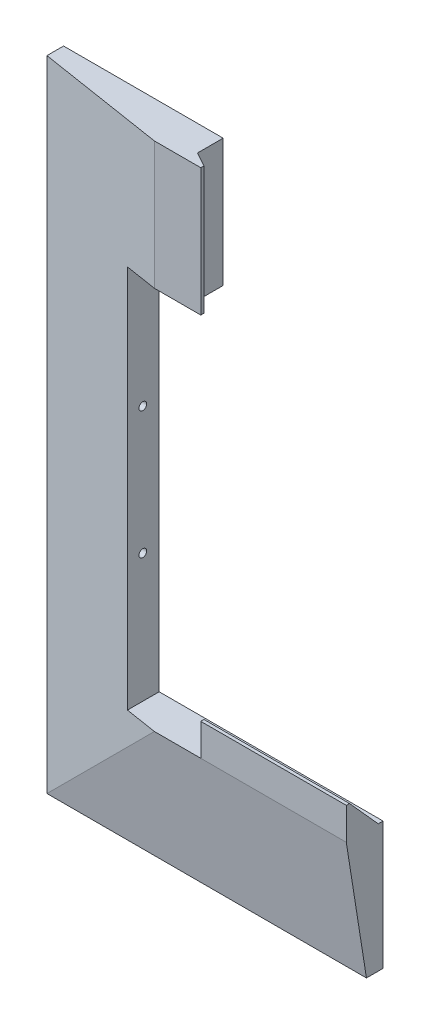
ISO-10303-21;
HEADER;
FILE_DESCRIPTION(('STEP AP214'),'2;1');
FILE_NAME('part.step','',(''),(''),'','','');
FILE_SCHEMA(('AUTOMOTIVE_DESIGN { 1 0 10303 214 1 1 1 1 }'));
ENDSEC;
DATA;
#1=APPLICATION_CONTEXT('core data for automotive mechanical design processes');
#2=APPLICATION_PROTOCOL_DEFINITION('international standard','automotive_design',2000,#1);
#3=PRODUCT_CONTEXT('',#1,'mechanical');
#4=PRODUCT('Part','Part','',(#3));
#5=PRODUCT_RELATED_PRODUCT_CATEGORY('part','',(#4));
#6=PRODUCT_DEFINITION_FORMATION('','',#4);
#7=PRODUCT_DEFINITION_CONTEXT('part definition',#1,'design');
#8=PRODUCT_DEFINITION('design','',#6,#7);
#9=PRODUCT_DEFINITION_SHAPE('','',#8);
#10=(LENGTH_UNIT() NAMED_UNIT(*) SI_UNIT(.MILLI.,.METRE.));
#11=(NAMED_UNIT(*) PLANE_ANGLE_UNIT() SI_UNIT($,.RADIAN.));
#12=(NAMED_UNIT(*) SI_UNIT($,.STERADIAN.) SOLID_ANGLE_UNIT());
#13=UNCERTAINTY_MEASURE_WITH_UNIT(LENGTH_MEASURE(1.E-05),#10,'distance_accuracy_value','');
#14=(GEOMETRIC_REPRESENTATION_CONTEXT(3) GLOBAL_UNCERTAINTY_ASSIGNED_CONTEXT((#13)) GLOBAL_UNIT_ASSIGNED_CONTEXT((#10,
#11,#12)) REPRESENTATION_CONTEXT('',''));
#15=CARTESIAN_POINT('',(0.,0.,0.));
#16=DIRECTION('',(0.,0.,1.));
#17=DIRECTION('',(1.,0.,0.));
#18=AXIS2_PLACEMENT_3D('',#15,#16,#17);
#19=CARTESIAN_POINT('',(18.5428324180509,83.245366469038,5.2));
#20=DIRECTION('',(-1.,0.,0.));
#21=DIRECTION('',(0.,-1.,0.));
#22=AXIS2_PLACEMENT_3D('',#19,#20,#21);
#23=PLANE('',#22);
#24=DIRECTION('',(0.,0.,-1.));
#25=VECTOR('',#24,1.);
#26=CARTESIAN_POINT('',(18.5428324180509,-76.654633530962,5.2));
#27=LINE('',#26,#25);
#28=CARTESIAN_POINT('',(18.5428324180509,-76.654633530962,1.5));
#29=VERTEX_POINT('',#28);
#30=CARTESIAN_POINT('',(18.5428324180509,-76.654633530962,0.));
#31=VERTEX_POINT('',#30);
#32=EDGE_CURVE('E642',#29,#31,#27,.T.);
#33=ORIENTED_EDGE('',*,*,#32,.F.);
#34=DIRECTION('',(0.,0.743294146247166,0.66896473162245));
#35=VECTOR('',#34,1.);
#36=CARTESIAN_POINT('',(18.5428324180509,-76.654633530962,1.5));
#37=LINE('',#36,#35);
#38=CARTESIAN_POINT('',(18.5428324180509,-66.654633530962,10.5));
#39=VERTEX_POINT('',#38);
#40=EDGE_CURVE('E270',#29,#39,#37,.T.);
#41=ORIENTED_EDGE('',*,*,#40,.T.);
#42=DIRECTION('',(0.,0.,1.));
#43=VECTOR('',#42,1.);
#44=CARTESIAN_POINT('',(18.5428324180509,-66.654633530962,10.5));
#45=LINE('',#44,#43);
#46=CARTESIAN_POINT('',(18.5428324180509,-66.654633530962,11.5));
#47=VERTEX_POINT('',#46);
#48=EDGE_CURVE('E245',#39,#47,#45,.T.);
#49=ORIENTED_EDGE('',*,*,#48,.T.);
#50=DIRECTION('',(0.,-1.,0.));
#51=VECTOR('',#50,1.);
#52=CARTESIAN_POINT('',(18.5428324180509,-66.654633530962,11.5));
#53=LINE('',#52,#51);
#54=CARTESIAN_POINT('',(18.5428324180509,-76.654633530962,11.5));
#55=VERTEX_POINT('',#54);
#56=EDGE_CURVE('E273',#47,#55,#53,.T.);
#57=ORIENTED_EDGE('',*,*,#56,.T.);
#58=DIRECTION('',(0.,-0.987762965329069,-0.155962573473011));
#59=VECTOR('',#58,1.);
#60=CARTESIAN_POINT('',(18.5428324180509,-76.654633530962,11.5));
#61=LINE('',#60,#59);
#62=CARTESIAN_POINT('',(18.5428324180509,-116.554633530962,5.2));
#63=VERTEX_POINT('',#62);
#64=EDGE_CURVE('E543',#55,#63,#61,.T.);
#65=ORIENTED_EDGE('',*,*,#64,.T.);
#66=DIRECTION('',(0.,0.,-1.));
#67=VECTOR('',#66,1.);
#68=CARTESIAN_POINT('',(18.5428324180509,-116.554633530962,5.2));
#69=LINE('',#68,#67);
#70=CARTESIAN_POINT('',(18.5428324180509,-116.554633530962,0.));
#71=VERTEX_POINT('',#70);
#72=EDGE_CURVE('E629',#63,#71,#69,.T.);
#73=ORIENTED_EDGE('',*,*,#72,.T.);
#74=DIRECTION('',(0.,1.,0.));
#75=VECTOR('',#74,1.);
#76=CARTESIAN_POINT('',(18.5428324180509,-76.654633530962,0.));
#77=LINE('',#76,#75);
#78=EDGE_CURVE('E637',#71,#31,#77,.T.);
#79=ORIENTED_EDGE('',*,*,#78,.T.);
#80=EDGE_LOOP('',(#33,#41,#49,#57,#65,#73,#79));
#81=FACE_BOUND('',#80,.T.);
#82=ADVANCED_FACE('F55',(#81),#23,.F.);
#83=CARTESIAN_POINT('',(0.,0.,11.5));
#84=DIRECTION('',(0.,0.,-1.));
#85=DIRECTION('',(-1.,0.,0.));
#86=AXIS2_PLACEMENT_3D('',#83,#84,#85);
#87=PLANE('',#86);
#88=DIRECTION('',(-1.,0.,0.));
#89=VECTOR('',#88,1.);
#90=CARTESIAN_POINT('',(0.,43.345366469038,11.5));
#91=LINE('',#90,#89);
#92=CARTESIAN_POINT('',(-26.9571675819491,43.345366469038,11.5));
#93=VERTEX_POINT('',#92);
#94=CARTESIAN_POINT('',(-41.4571675819491,43.3453664690379,11.5));
#95=VERTEX_POINT('',#94);
#96=EDGE_CURVE('E399',#93,#95,#91,.T.);
#97=ORIENTED_EDGE('',*,*,#96,.F.);
#98=DIRECTION('',(0.,1.,0.));
#99=VECTOR('',#98,1.);
#100=CARTESIAN_POINT('',(-26.9571675819491,43.345366469038,11.5));
#101=LINE('',#100,#99);
#102=CARTESIAN_POINT('',(-26.9571675819491,83.245366469038,11.5));
#103=VERTEX_POINT('',#102);
#104=EDGE_CURVE('E290',#93,#103,#101,.T.);
#105=ORIENTED_EDGE('',*,*,#104,.T.);
#106=DIRECTION('',(1.,0.,0.));
#107=VECTOR('',#106,1.);
#108=CARTESIAN_POINT('',(-31.4571675819491,83.245366469038,11.5));
#109=LINE('',#108,#107);
#110=CARTESIAN_POINT('',(-31.4571675819491,83.245366469038,11.5));
#111=VERTEX_POINT('',#110);
#112=EDGE_CURVE('E277',#111,#103,#109,.T.);
#113=ORIENTED_EDGE('',*,*,#112,.F.);
#114=DIRECTION('',(-1.,0.,0.));
#115=VECTOR('',#114,1.);
#116=CARTESIAN_POINT('',(-41.4571675819491,83.245366469038,11.5));
#117=LINE('',#116,#115);
#118=CARTESIAN_POINT('',(-41.4571675819491,83.245366469038,11.5));
#119=VERTEX_POINT('',#118);
#120=EDGE_CURVE('E471',#111,#119,#117,.T.);
#121=ORIENTED_EDGE('',*,*,#120,.T.);
#122=DIRECTION('',(0.,-1.,0.));
#123=VECTOR('',#122,1.);
#124=CARTESIAN_POINT('',(-41.4571675819491,-76.654633530962,11.5));
#125=LINE('',#124,#123);
#126=EDGE_CURVE('E491',#119,#95,#125,.T.);
#127=ORIENTED_EDGE('',*,*,#126,.T.);
#128=EDGE_LOOP('',(#97,#105,#113,#121,#127));
#129=FACE_BOUND('',#128,.T.);
#130=ADVANCED_FACE('F499',(#129),#87,.F.);
#131=CARTESIAN_POINT('',(-2.78003921145281,0.,17.6069150058678));
#132=DIRECTION('',(-0.155962573473011,0.,0.987762965329069));
#133=DIRECTION('',(0.987762965329069,0.,0.155962573473011));
#134=AXIS2_PLACEMENT_3D('',#131,#132,#133);
#135=PLANE('',#134);
#136=DIRECTION('',(0.,-1.,0.));
#137=VECTOR('',#136,1.);
#138=CARTESIAN_POINT('',(-51.4571675819491,0.,9.92105263157894));
#139=LINE('',#138,#137);
#140=CARTESIAN_POINT('',(-51.4571675819491,43.3453664690379,9.92105263157894));
#141=VERTEX_POINT('',#140);
#142=CARTESIAN_POINT('',(-51.4571675819491,-76.654633530962,9.92105263157894));
#143=VERTEX_POINT('',#142);
#144=EDGE_CURVE('E583',#141,#143,#139,.T.);
#145=ORIENTED_EDGE('',*,*,#144,.F.);
#146=DIRECTION('',(0.987762965329069,0.,0.155962573473011));
#147=VECTOR('',#146,1.);
#148=CARTESIAN_POINT('',(-2.78003921145282,43.345366469038,17.6069150058678));
#149=LINE('',#148,#147);
#150=EDGE_CURVE('E566',#141,#95,#149,.T.);
#151=ORIENTED_EDGE('',*,*,#150,.T.);
#152=ORIENTED_EDGE('',*,*,#126,.F.);
#153=DIRECTION('',(-0.987762965329069,0.,-0.155962573473011));
#154=VECTOR('',#153,1.);
#155=CARTESIAN_POINT('',(-41.4571675819491,83.245366469038,11.5));
#156=LINE('',#155,#154);
#157=CARTESIAN_POINT('',(-81.3571675819492,83.245366469038,5.2));
#158=VERTEX_POINT('',#157);
#159=EDGE_CURVE('E527',#119,#158,#156,.T.);
#160=ORIENTED_EDGE('',*,*,#159,.T.);
#161=DIRECTION('',(0.,1.,0.));
#162=VECTOR('',#161,1.);
#163=CARTESIAN_POINT('',(-81.3571675819491,0.,5.2));
#164=LINE('',#163,#162);
#165=CARTESIAN_POINT('',(-81.3571675819491,-116.554633530962,5.2));
#166=VERTEX_POINT('',#165);
#167=EDGE_CURVE('E662',#158,#166,#164,.F.);
#168=ORIENTED_EDGE('',*,*,#167,.T.);
#169=DIRECTION('',(-0.702740385382544,-0.702740385382543,-0.110959008218296));
#170=VECTOR('',#169,1.);
#171=CARTESIAN_POINT('',(-41.4571675819491,-76.654633530962,11.5));
#172=LINE('',#171,#170);
#173=CARTESIAN_POINT('',(-41.4571675819491,-76.654633530962,11.5));
#174=VERTEX_POINT('',#173);
#175=EDGE_CURVE('E537',#174,#166,#172,.T.);
#176=ORIENTED_EDGE('',*,*,#175,.F.);
#177=DIRECTION('',(-0.987762965329069,0.,-0.155962573473011));
#178=VECTOR('',#177,1.);
#179=CARTESIAN_POINT('',(-2.78003921145279,-76.654633530962,17.6069150058678));
#180=LINE('',#179,#178);
#181=EDGE_CURVE('E587',#174,#143,#180,.T.);
#182=ORIENTED_EDGE('',*,*,#181,.T.);
#183=EDGE_LOOP('',(#145,#151,#152,#160,#168,#176,#182));
#184=FACE_BOUND('',#183,.T.);
#185=ADVANCED_FACE('F509',(#184),#135,.T.);
#186=CARTESIAN_POINT('',(-81.3571675819492,83.245366469038,5.2));
#187=DIRECTION('',(1.,0.,0.));
#188=DIRECTION('',(0.,1.,0.));
#189=AXIS2_PLACEMENT_3D('',#186,#187,#188);
#190=PLANE('',#189);
#191=DIRECTION('',(0.,-1.,0.));
#192=VECTOR('',#191,1.);
#193=CARTESIAN_POINT('',(-81.3571675819492,83.245366469038,0.));
#194=LINE('',#193,#192);
#195=CARTESIAN_POINT('',(-81.3571675819492,83.245366469038,0.));
#196=VERTEX_POINT('',#195);
#197=CARTESIAN_POINT('',(-81.3571675819491,-116.554633530962,0.));
#198=VERTEX_POINT('',#197);
#199=EDGE_CURVE('E536',#196,#198,#194,.T.);
#200=ORIENTED_EDGE('',*,*,#199,.T.);
#201=DIRECTION('',(0.,0.,-1.));
#202=VECTOR('',#201,1.);
#203=CARTESIAN_POINT('',(-81.3571675819491,-116.554633530962,5.2));
#204=LINE('',#203,#202);
#205=EDGE_CURVE('E594',#166,#198,#204,.T.);
#206=ORIENTED_EDGE('',*,*,#205,.F.);
#207=ORIENTED_EDGE('',*,*,#167,.F.);
#208=DIRECTION('',(0.,0.,-1.));
#209=VECTOR('',#208,1.);
#210=CARTESIAN_POINT('',(-81.3571675819492,83.245366469038,5.2));
#211=LINE('',#210,#209);
#212=EDGE_CURVE('E575',#158,#196,#211,.T.);
#213=ORIENTED_EDGE('',*,*,#212,.T.);
#214=EDGE_LOOP('',(#200,#206,#207,#213));
#215=FACE_BOUND('',#214,.T.);
#216=ADVANCED_FACE('F57',(#215),#190,.F.);
#217=CARTESIAN_POINT('',(-81.3571675819491,-116.554633530962,5.2));
#218=DIRECTION('',(0.,1.,0.));
#219=DIRECTION('',(-1.,0.,0.));
#220=AXIS2_PLACEMENT_3D('',#217,#218,#219);
#221=PLANE('',#220);
#222=DIRECTION('',(1.,0.,0.));
#223=VECTOR('',#222,1.);
#224=CARTESIAN_POINT('',(-81.3571675819491,-116.554633530962,0.));
#225=LINE('',#224,#223);
#226=EDGE_CURVE('E628',#198,#71,#225,.T.);
#227=ORIENTED_EDGE('',*,*,#226,.T.);
#228=ORIENTED_EDGE('',*,*,#72,.F.);
#229=DIRECTION('',(1.,0.,0.));
#230=VECTOR('',#229,1.);
#231=CARTESIAN_POINT('',(0.,-116.554633530962,5.2));
#232=LINE('',#231,#230);
#233=EDGE_CURVE('E686',#166,#63,#232,.T.);
#234=ORIENTED_EDGE('',*,*,#233,.F.);
#235=ORIENTED_EDGE('',*,*,#205,.T.);
#236=EDGE_LOOP('',(#227,#228,#234,#235));
#237=FACE_BOUND('',#236,.T.);
#238=ADVANCED_FACE('F619',(#237),#221,.F.);
#239=CARTESIAN_POINT('',(-51.4571675819491,-76.654633530962,5.2));
#240=DIRECTION('',(0.,-1.,0.));
#241=DIRECTION('',(1.,0.,0.));
#242=AXIS2_PLACEMENT_3D('',#239,#240,#241);
#243=PLANE('',#242);
#244=DIRECTION('',(0.,0.,-1.));
#245=VECTOR('',#244,1.);
#246=CARTESIAN_POINT('',(-26.9571675819491,-76.654633530962,11.5));
#247=LINE('',#246,#245);
#248=CARTESIAN_POINT('',(-26.9571675819491,-76.654633530962,11.5));
#249=VERTEX_POINT('',#248);
#250=CARTESIAN_POINT('',(-26.9571675819491,-76.654633530962,1.5));
#251=VERTEX_POINT('',#250);
#252=EDGE_CURVE('E73',#249,#251,#247,.T.);
#253=ORIENTED_EDGE('',*,*,#252,.T.);
#254=DIRECTION('',(1.,0.,0.));
#255=VECTOR('',#254,1.);
#256=CARTESIAN_POINT('',(-26.9571675819491,-76.654633530962,1.5));
#257=LINE('',#256,#255);
#258=EDGE_CURVE('E77',#251,#29,#257,.T.);
#259=ORIENTED_EDGE('',*,*,#258,.T.);
#260=ORIENTED_EDGE('',*,*,#32,.T.);
#261=DIRECTION('',(-1.,0.,0.));
#262=VECTOR('',#261,1.);
#263=CARTESIAN_POINT('',(-51.4571675819491,-76.654633530962,0.));
#264=LINE('',#263,#262);
#265=CARTESIAN_POINT('',(-51.4571675819491,-76.654633530962,0.));
#266=VERTEX_POINT('',#265);
#267=EDGE_CURVE('E646',#31,#266,#264,.T.);
#268=ORIENTED_EDGE('',*,*,#267,.T.);
#269=DIRECTION('',(0.,0.,-1.));
#270=VECTOR('',#269,1.);
#271=CARTESIAN_POINT('',(-51.4571675819491,-76.654633530962,5.2));
#272=LINE('',#271,#270);
#273=EDGE_CURVE('E666',#143,#266,#272,.T.);
#274=ORIENTED_EDGE('',*,*,#273,.F.);
#275=ORIENTED_EDGE('',*,*,#181,.F.);
#276=DIRECTION('',(1.,0.,0.));
#277=VECTOR('',#276,1.);
#278=CARTESIAN_POINT('',(-41.4571675819491,-76.654633530962,11.5));
#279=LINE('',#278,#277);
#280=EDGE_CURVE('E481',#174,#249,#279,.T.);
#281=ORIENTED_EDGE('',*,*,#280,.T.);
#282=EDGE_LOOP('',(#253,#259,#260,#268,#274,#275,#281));
#283=FACE_BOUND('',#282,.T.);
#284=ADVANCED_FACE('F616',(#283),#243,.F.);
#285=CARTESIAN_POINT('',(-51.4571675819491,43.345366469038,5.2));
#286=DIRECTION('',(-1.,0.,0.));
#287=DIRECTION('',(0.,-1.,0.));
#288=AXIS2_PLACEMENT_3D('',#285,#286,#287);
#289=PLANE('',#288);
#290=DIRECTION('',(0.,1.,0.));
#291=VECTOR('',#290,1.);
#292=CARTESIAN_POINT('',(-51.4571675819491,43.345366469038,0.));
#293=LINE('',#292,#291);
#294=CARTESIAN_POINT('',(-51.4571675819491,43.345366469038,0.));
#295=VERTEX_POINT('',#294);
#296=EDGE_CURVE('E650',#266,#295,#293,.T.);
#297=ORIENTED_EDGE('',*,*,#296,.T.);
#298=DIRECTION('',(0.,0.,-1.));
#299=VECTOR('',#298,1.);
#300=CARTESIAN_POINT('',(-51.4571675819491,43.345366469038,5.2));
#301=LINE('',#300,#299);
#302=EDGE_CURVE('E663',#141,#295,#301,.T.);
#303=ORIENTED_EDGE('',*,*,#302,.F.);
#304=ORIENTED_EDGE('',*,*,#144,.T.);
#305=ORIENTED_EDGE('',*,*,#273,.T.);
#306=EDGE_LOOP('',(#297,#303,#304,#305));
#307=FACE_BOUND('',#306,.T.);
#308=CARTESIAN_POINT('',(-51.4571675819491,3.24536646903796,5.12));
#309=DIRECTION('',(1.,0.,0.));
#310=DIRECTION('',(0.,1.,0.));
#311=AXIS2_PLACEMENT_3D('',#308,#309,#310);
#312=CIRCLE('',#311,1.2);
#313=CARTESIAN_POINT('',(-51.4571675819491,4.44536646903796,5.12));
#314=VERTEX_POINT('',#313);
#315=EDGE_CURVE('E340',#314,#314,#312,.T.);
#316=ORIENTED_EDGE('',*,*,#315,.F.);
#317=EDGE_LOOP('',(#316));
#318=FACE_BOUND('',#317,.T.);
#319=CARTESIAN_POINT('',(-51.4571675819491,-36.554633530962,5.12));
#320=DIRECTION('',(1.,0.,0.));
#321=DIRECTION('',(0.,1.,0.));
#322=AXIS2_PLACEMENT_3D('',#319,#320,#321);
#323=CIRCLE('',#322,1.2);
#324=CARTESIAN_POINT('',(-51.4571675819491,-35.354633530962,5.12));
#325=VERTEX_POINT('',#324);
#326=EDGE_CURVE('E312',#325,#325,#323,.T.);
#327=ORIENTED_EDGE('',*,*,#326,.F.);
#328=EDGE_LOOP('',(#327));
#329=FACE_BOUND('',#328,.T.);
#330=ADVANCED_FACE('F613',(#307,#318,#329),#289,.F.);
#331=CARTESIAN_POINT('',(-51.4571675819491,43.345366469038,5.2));
#332=DIRECTION('',(0.,1.,0.));
#333=DIRECTION('',(0.,0.,1.));
#334=AXIS2_PLACEMENT_3D('',#331,#332,#333);
#335=PLANE('',#334);
#336=DIRECTION('',(1.,0.,0.));
#337=VECTOR('',#336,1.);
#338=CARTESIAN_POINT('',(-51.4571675819491,43.345366469038,0.));
#339=LINE('',#338,#337);
#340=CARTESIAN_POINT('',(-31.4571675819491,43.345366469038,0.));
#341=VERTEX_POINT('',#340);
#342=EDGE_CURVE('E655',#295,#341,#339,.T.);
#343=ORIENTED_EDGE('',*,*,#342,.T.);
#344=DIRECTION('',(0.,0.,1.));
#345=VECTOR('',#344,1.);
#346=CARTESIAN_POINT('',(-31.4571675819491,43.345366469038,-12.5));
#347=LINE('',#346,#345);
#348=CARTESIAN_POINT('',(-31.4571675819491,43.345366469038,7.99999999999999));
#349=VERTEX_POINT('',#348);
#350=EDGE_CURVE('E302',#341,#349,#347,.T.);
#351=ORIENTED_EDGE('',*,*,#350,.T.);
#352=DIRECTION('',(-0.874157276121538,0.,-0.485642931178632));
#353=VECTOR('',#352,1.);
#354=CARTESIAN_POINT('',(-26.9571675819491,43.345366469038,10.5));
#355=LINE('',#354,#353);
#356=CARTESIAN_POINT('',(-26.9571675819491,43.345366469038,10.5));
#357=VERTEX_POINT('',#356);
#358=EDGE_CURVE('E285',#357,#349,#355,.T.);
#359=ORIENTED_EDGE('',*,*,#358,.F.);
#360=DIRECTION('',(0.,0.,-1.));
#361=VECTOR('',#360,1.);
#362=CARTESIAN_POINT('',(-26.9571675819491,43.345366469038,11.5));
#363=LINE('',#362,#361);
#364=EDGE_CURVE('E281',#93,#357,#363,.T.);
#365=ORIENTED_EDGE('',*,*,#364,.F.);
#366=ORIENTED_EDGE('',*,*,#96,.T.);
#367=ORIENTED_EDGE('',*,*,#150,.F.);
#368=ORIENTED_EDGE('',*,*,#302,.T.);
#369=EDGE_LOOP('',(#343,#351,#359,#365,#366,#367,#368));
#370=FACE_BOUND('',#369,.T.);
#371=ADVANCED_FACE('F608',(#370),#335,.F.);
#372=CARTESIAN_POINT('',(-81.3571675819492,83.245366469038,5.2));
#373=DIRECTION('',(0.,-1.,0.));
#374=DIRECTION('',(1.,0.,0.));
#375=AXIS2_PLACEMENT_3D('',#372,#373,#374);
#376=PLANE('',#375);
#377=ORIENTED_EDGE('',*,*,#120,.F.);
#378=ORIENTED_EDGE('',*,*,#112,.T.);
#379=DIRECTION('',(0.,0.,-1.));
#380=VECTOR('',#379,1.);
#381=CARTESIAN_POINT('',(-26.9571675819491,83.245366469038,11.5));
#382=LINE('',#381,#380);
#383=CARTESIAN_POINT('',(-26.9571675819491,83.245366469038,10.5));
#384=VERTEX_POINT('',#383);
#385=EDGE_CURVE('E291',#103,#384,#382,.T.);
#386=ORIENTED_EDGE('',*,*,#385,.T.);
#387=DIRECTION('',(-0.874157276121538,0.,-0.485642931178632));
#388=VECTOR('',#387,1.);
#389=CARTESIAN_POINT('',(-26.9571675819491,83.245366469038,10.5));
#390=LINE('',#389,#388);
#391=CARTESIAN_POINT('',(-31.4571675819491,83.245366469038,7.99999999999999));
#392=VERTEX_POINT('',#391);
#393=EDGE_CURVE('E286',#384,#392,#390,.T.);
#394=ORIENTED_EDGE('',*,*,#393,.T.);
#395=DIRECTION('',(0.,0.,1.));
#396=VECTOR('',#395,1.);
#397=CARTESIAN_POINT('',(-31.4571675819491,83.245366469038,-12.5));
#398=LINE('',#397,#396);
#399=CARTESIAN_POINT('',(-31.4571675819491,83.245366469038,0.));
#400=VERTEX_POINT('',#399);
#401=EDGE_CURVE('E311',#400,#392,#398,.T.);
#402=ORIENTED_EDGE('',*,*,#401,.F.);
#403=DIRECTION('',(-1.,0.,0.));
#404=VECTOR('',#403,1.);
#405=CARTESIAN_POINT('',(-81.3571675819492,83.245366469038,0.));
#406=LINE('',#405,#404);
#407=EDGE_CURVE('E659',#400,#196,#406,.T.);
#408=ORIENTED_EDGE('',*,*,#407,.T.);
#409=ORIENTED_EDGE('',*,*,#212,.F.);
#410=ORIENTED_EDGE('',*,*,#159,.F.);
#411=EDGE_LOOP('',(#377,#378,#386,#394,#402,#408,#409,#410));
#412=FACE_BOUND('',#411,.T.);
#413=ADVANCED_FACE('F573',(#412),#376,.F.);
#414=CARTESIAN_POINT('',(0.,0.,0.));
#415=DIRECTION('',(0.,0.,1.));
#416=DIRECTION('',(1.,0.,0.));
#417=AXIS2_PLACEMENT_3D('',#414,#415,#416);
#418=PLANE('',#417);
#419=ORIENTED_EDGE('',*,*,#407,.F.);
#420=DIRECTION('',(0.,-1.,0.));
#421=VECTOR('',#420,1.);
#422=CARTESIAN_POINT('',(-31.4571675819491,0.,0.));
#423=LINE('',#422,#421);
#424=EDGE_CURVE('E12',#400,#341,#423,.T.);
#425=ORIENTED_EDGE('',*,*,#424,.T.);
#426=ORIENTED_EDGE('',*,*,#342,.F.);
#427=ORIENTED_EDGE('',*,*,#296,.F.);
#428=ORIENTED_EDGE('',*,*,#267,.F.);
#429=ORIENTED_EDGE('',*,*,#78,.F.);
#430=ORIENTED_EDGE('',*,*,#226,.F.);
#431=ORIENTED_EDGE('',*,*,#199,.F.);
#432=EDGE_LOOP('',(#419,#425,#426,#427,#428,#429,#430,#431));
#433=FACE_BOUND('',#432,.T.);
#434=ADVANCED_FACE('F517',(#433),#418,.F.);
#435=CARTESIAN_POINT('',(0.,-3.63619378859097,23.0292273277428));
#436=DIRECTION('',(0.,-0.155962573473011,0.987762965329069));
#437=DIRECTION('',(0.,-0.987762965329069,-0.155962573473011));
#438=AXIS2_PLACEMENT_3D('',#435,#436,#437);
#439=PLANE('',#438);
#440=ORIENTED_EDGE('',*,*,#175,.T.);
#441=ORIENTED_EDGE('',*,*,#233,.T.);
#442=ORIENTED_EDGE('',*,*,#64,.F.);
#443=DIRECTION('',(1.,0.,0.));
#444=VECTOR('',#443,1.);
#445=CARTESIAN_POINT('',(-26.9571675819491,-76.654633530962,11.5));
#446=LINE('',#445,#444);
#447=EDGE_CURVE('E263',#249,#55,#446,.T.);
#448=ORIENTED_EDGE('',*,*,#447,.F.);
#449=ORIENTED_EDGE('',*,*,#280,.F.);
#450=EDGE_LOOP('',(#440,#441,#442,#448,#449));
#451=FACE_BOUND('',#450,.T.);
#452=ADVANCED_FACE('F512',(#451),#439,.T.);
#453=CARTESIAN_POINT('',(-55.2571675819491,3.24536646903796,5.12));
#454=DIRECTION('',(1.,0.,0.));
#455=DIRECTION('',(0.,1.,0.));
#456=AXIS2_PLACEMENT_3D('',#453,#454,#455);
#457=PLANE('',#456);
#458=CARTESIAN_POINT('',(-55.2571675819491,3.24536646903796,5.12));
#459=DIRECTION('',(1.,0.,0.));
#460=DIRECTION('',(0.,1.,0.));
#461=AXIS2_PLACEMENT_3D('',#458,#459,#460);
#462=CIRCLE('',#461,1.2);
#463=CARTESIAN_POINT('',(-55.2571675819491,4.44536646903796,5.12));
#464=VERTEX_POINT('',#463);
#465=EDGE_CURVE('E341',#464,#464,#462,.T.);
#466=ORIENTED_EDGE('',*,*,#465,.T.);
#467=EDGE_LOOP('',(#466));
#468=FACE_BOUND('',#467,.T.);
#469=DIRECTION('',(0.,0.5,-0.866025403784438));
#470=VECTOR('',#469,1.);
#471=CARTESIAN_POINT('',(-55.2571675819491,5.67023759963439,5.12));
#472=LINE('',#471,#470);
#473=CARTESIAN_POINT('',(-55.2571675819491,4.45780203433617,7.22));
#474=VERTEX_POINT('',#473);
#475=CARTESIAN_POINT('',(-55.2571675819491,5.67023759963439,5.12));
#476=VERTEX_POINT('',#475);
#477=EDGE_CURVE('E562',#474,#476,#472,.T.);
#478=ORIENTED_EDGE('',*,*,#477,.T.);
#479=DIRECTION('',(0.,-0.5,-0.866025403784439));
#480=VECTOR('',#479,1.);
#481=CARTESIAN_POINT('',(-55.2571675819491,4.45780203433618,3.02));
#482=LINE('',#481,#480);
#483=CARTESIAN_POINT('',(-55.2571675819491,4.45780203433618,3.02));
#484=VERTEX_POINT('',#483);
#485=EDGE_CURVE('E364',#476,#484,#482,.T.);
#486=ORIENTED_EDGE('',*,*,#485,.T.);
#487=DIRECTION('',(0.,-1.,0.));
#488=VECTOR('',#487,1.);
#489=CARTESIAN_POINT('',(-55.2571675819491,2.03293090373974,3.02));
#490=LINE('',#489,#488);
#491=CARTESIAN_POINT('',(-55.2571675819491,2.03293090373974,3.02));
#492=VERTEX_POINT('',#491);
#493=EDGE_CURVE('E360',#484,#492,#490,.T.);
#494=ORIENTED_EDGE('',*,*,#493,.T.);
#495=DIRECTION('',(0.,-0.5,0.866025403784439));
#496=VECTOR('',#495,1.);
#497=CARTESIAN_POINT('',(-55.2571675819491,0.82049533844153,5.12));
#498=LINE('',#497,#496);
#499=CARTESIAN_POINT('',(-55.2571675819491,0.82049533844153,5.12));
#500=VERTEX_POINT('',#499);
#501=EDGE_CURVE('E356',#492,#500,#498,.T.);
#502=ORIENTED_EDGE('',*,*,#501,.T.);
#503=DIRECTION('',(0.,0.5,0.866025403784439));
#504=VECTOR('',#503,1.);
#505=CARTESIAN_POINT('',(-55.2571675819491,2.03293090373975,7.22));
#506=LINE('',#505,#504);
#507=CARTESIAN_POINT('',(-55.2571675819491,2.03293090373975,7.22));
#508=VERTEX_POINT('',#507);
#509=EDGE_CURVE('E352',#500,#508,#506,.T.);
#510=ORIENTED_EDGE('',*,*,#509,.T.);
#511=DIRECTION('',(0.,1.,0.));
#512=VECTOR('',#511,1.);
#513=CARTESIAN_POINT('',(-55.2571675819491,4.45780203433617,7.22));
#514=LINE('',#513,#512);
#515=EDGE_CURVE('E345',#508,#474,#514,.T.);
#516=ORIENTED_EDGE('',*,*,#515,.T.);
#517=EDGE_LOOP('',(#478,#486,#494,#502,#510,#516));
#518=FACE_BOUND('',#517,.T.);
#519=ADVANCED_FACE('F516',(#468,#518),#457,.F.);
#520=CARTESIAN_POINT('',(-55.2571675819491,3.24536646903796,5.12));
#521=DIRECTION('',(1.,0.,0.));
#522=DIRECTION('',(0.,1.,0.));
#523=AXIS2_PLACEMENT_3D('',#520,#521,#522);
#524=CYLINDRICAL_SURFACE('',#523,1.2);
#525=ORIENTED_EDGE('',*,*,#465,.F.);
#526=EDGE_LOOP('',(#525));
#527=FACE_BOUND('',#526,.T.);
#528=ORIENTED_EDGE('',*,*,#315,.T.);
#529=EDGE_LOOP('',(#528));
#530=FACE_BOUND('',#529,.T.);
#531=ADVANCED_FACE('F733',(#527,#530),#524,.F.);
#532=CARTESIAN_POINT('',(-57.0571675819491,0.,0.));
#533=DIRECTION('',(1.,0.,0.));
#534=DIRECTION('',(0.,0.,-1.));
#535=AXIS2_PLACEMENT_3D('',#532,#533,#534);
#536=PLANE('',#535);
#537=DIRECTION('',(0.,0.5,0.866025403784439));
#538=VECTOR('',#537,1.);
#539=CARTESIAN_POINT('',(-57.0571675819491,4.45780203433617,3.02));
#540=LINE('',#539,#538);
#541=CARTESIAN_POINT('',(-57.0571675819491,4.45780203433617,3.02));
#542=VERTEX_POINT('',#541);
#543=CARTESIAN_POINT('',(-57.0571675819491,5.67023759963439,5.12));
#544=VERTEX_POINT('',#543);
#545=EDGE_CURVE('E374',#542,#544,#540,.T.);
#546=ORIENTED_EDGE('',*,*,#545,.T.);
#547=DIRECTION('',(0.,-0.5,0.866025403784438));
#548=VECTOR('',#547,1.);
#549=CARTESIAN_POINT('',(-57.0571675819491,5.67023759963439,5.12));
#550=LINE('',#549,#548);
#551=CARTESIAN_POINT('',(-57.0571675819491,4.45780203433617,7.22));
#552=VERTEX_POINT('',#551);
#553=EDGE_CURVE('E456',#544,#552,#550,.T.);
#554=ORIENTED_EDGE('',*,*,#553,.T.);
#555=DIRECTION('',(0.,-1.,0.));
#556=VECTOR('',#555,1.);
#557=CARTESIAN_POINT('',(-57.0571675819491,4.45780203433617,7.22));
#558=LINE('',#557,#556);
#559=CARTESIAN_POINT('',(-57.0571675819491,2.03293090373974,7.22));
#560=VERTEX_POINT('',#559);
#561=EDGE_CURVE('E452',#552,#560,#558,.T.);
#562=ORIENTED_EDGE('',*,*,#561,.T.);
#563=DIRECTION('',(0.,-0.5,-0.866025403784439));
#564=VECTOR('',#563,1.);
#565=CARTESIAN_POINT('',(-57.0571675819491,2.03293090373974,7.22));
#566=LINE('',#565,#564);
#567=CARTESIAN_POINT('',(-57.0571675819491,0.82049533844153,5.12));
#568=VERTEX_POINT('',#567);
#569=EDGE_CURVE('E448',#560,#568,#566,.T.);
#570=ORIENTED_EDGE('',*,*,#569,.T.);
#571=DIRECTION('',(0.,0.5,-0.866025403784439));
#572=VECTOR('',#571,1.);
#573=CARTESIAN_POINT('',(-57.0571675819491,0.82049533844153,5.12));
#574=LINE('',#573,#572);
#575=CARTESIAN_POINT('',(-57.0571675819491,2.03293090373974,3.02));
#576=VERTEX_POINT('',#575);
#577=EDGE_CURVE('E444',#568,#576,#574,.T.);
#578=ORIENTED_EDGE('',*,*,#577,.T.);
#579=DIRECTION('',(0.,1.,0.));
#580=VECTOR('',#579,1.);
#581=CARTESIAN_POINT('',(-57.0571675819491,2.03293090373974,3.02));
#582=LINE('',#581,#580);
#583=EDGE_CURVE('E421',#576,#542,#582,.T.);
#584=ORIENTED_EDGE('',*,*,#583,.T.);
#585=EDGE_LOOP('',(#546,#554,#562,#570,#578,#584));
#586=FACE_BOUND('',#585,.T.);
#587=ADVANCED_FACE('F510',(#586),#536,.T.);
#588=CARTESIAN_POINT('',(-57.0571675819491,5.67023759963439,5.12));
#589=DIRECTION('',(0.,0.866025403784438,0.5));
#590=DIRECTION('',(0.,-0.5,0.866025403784438));
#591=AXIS2_PLACEMENT_3D('',#588,#589,#590);
#592=PLANE('',#591);
#593=ORIENTED_EDGE('',*,*,#477,.F.);
#594=DIRECTION('',(1.,0.,0.));
#595=VECTOR('',#594,1.);
#596=CARTESIAN_POINT('',(-57.0571675819491,4.45780203433617,7.22));
#597=LINE('',#596,#595);
#598=EDGE_CURVE('E422',#552,#474,#597,.T.);
#599=ORIENTED_EDGE('',*,*,#598,.F.);
#600=ORIENTED_EDGE('',*,*,#553,.F.);
#601=DIRECTION('',(1.,0.,0.));
#602=VECTOR('',#601,1.);
#603=CARTESIAN_POINT('',(-57.0571675819491,5.67023759963439,5.12));
#604=LINE('',#603,#602);
#605=EDGE_CURVE('E418',#544,#476,#604,.T.);
#606=ORIENTED_EDGE('',*,*,#605,.T.);
#607=EDGE_LOOP('',(#593,#599,#600,#606));
#608=FACE_BOUND('',#607,.T.);
#609=ADVANCED_FACE('F767',(#608),#592,.F.);
#610=CARTESIAN_POINT('',(-57.0571675819491,4.45780203433617,7.22));
#611=DIRECTION('',(0.,0.,1.));
#612=DIRECTION('',(1.,0.,0.));
#613=AXIS2_PLACEMENT_3D('',#610,#611,#612);
#614=PLANE('',#613);
#615=ORIENTED_EDGE('',*,*,#515,.F.);
#616=DIRECTION('',(1.,0.,0.));
#617=VECTOR('',#616,1.);
#618=CARTESIAN_POINT('',(-57.0571675819491,2.03293090373974,7.22));
#619=LINE('',#618,#617);
#620=EDGE_CURVE('E426',#560,#508,#619,.T.);
#621=ORIENTED_EDGE('',*,*,#620,.F.);
#622=ORIENTED_EDGE('',*,*,#561,.F.);
#623=ORIENTED_EDGE('',*,*,#598,.T.);
#624=EDGE_LOOP('',(#615,#621,#622,#623));
#625=FACE_BOUND('',#624,.T.);
#626=ADVANCED_FACE('F770',(#625),#614,.F.);
#627=CARTESIAN_POINT('',(-57.0571675819491,2.03293090373974,7.22));
#628=DIRECTION('',(0.,-0.866025403784438,0.5));
#629=DIRECTION('',(0.,-0.5,-0.866025403784439));
#630=AXIS2_PLACEMENT_3D('',#627,#628,#629);
#631=PLANE('',#630);
#632=ORIENTED_EDGE('',*,*,#509,.F.);
#633=DIRECTION('',(1.,0.,0.));
#634=VECTOR('',#633,1.);
#635=CARTESIAN_POINT('',(-57.0571675819491,0.82049533844153,5.12));
#636=LINE('',#635,#634);
#637=EDGE_CURVE('E430',#568,#500,#636,.T.);
#638=ORIENTED_EDGE('',*,*,#637,.F.);
#639=ORIENTED_EDGE('',*,*,#569,.F.);
#640=ORIENTED_EDGE('',*,*,#620,.T.);
#641=EDGE_LOOP('',(#632,#638,#639,#640));
#642=FACE_BOUND('',#641,.T.);
#643=ADVANCED_FACE('F774',(#642),#631,.F.);
#644=CARTESIAN_POINT('',(-57.0571675819491,0.82049533844153,5.12));
#645=DIRECTION('',(0.,-0.866025403784439,-0.5));
#646=DIRECTION('',(0.,0.5,-0.866025403784439));
#647=AXIS2_PLACEMENT_3D('',#644,#645,#646);
#648=PLANE('',#647);
#649=ORIENTED_EDGE('',*,*,#501,.F.);
#650=DIRECTION('',(1.,0.,0.));
#651=VECTOR('',#650,1.);
#652=CARTESIAN_POINT('',(-57.0571675819491,2.03293090373974,3.02));
#653=LINE('',#652,#651);
#654=EDGE_CURVE('E434',#576,#492,#653,.T.);
#655=ORIENTED_EDGE('',*,*,#654,.F.);
#656=ORIENTED_EDGE('',*,*,#577,.F.);
#657=ORIENTED_EDGE('',*,*,#637,.T.);
#658=EDGE_LOOP('',(#649,#655,#656,#657));
#659=FACE_BOUND('',#658,.T.);
#660=ADVANCED_FACE('F778',(#659),#648,.F.);
#661=CARTESIAN_POINT('',(-57.0571675819491,2.03293090373974,3.02));
#662=DIRECTION('',(0.,0.,-1.));
#663=DIRECTION('',(0.,1.,0.));
#664=AXIS2_PLACEMENT_3D('',#661,#662,#663);
#665=PLANE('',#664);
#666=ORIENTED_EDGE('',*,*,#493,.F.);
#667=DIRECTION('',(1.,0.,0.));
#668=VECTOR('',#667,1.);
#669=CARTESIAN_POINT('',(-57.0571675819491,4.45780203433617,3.02));
#670=LINE('',#669,#668);
#671=EDGE_CURVE('E368',#542,#484,#670,.T.);
#672=ORIENTED_EDGE('',*,*,#671,.F.);
#673=ORIENTED_EDGE('',*,*,#583,.F.);
#674=ORIENTED_EDGE('',*,*,#654,.T.);
#675=EDGE_LOOP('',(#666,#672,#673,#674));
#676=FACE_BOUND('',#675,.T.);
#677=ADVANCED_FACE('F765',(#676),#665,.F.);
#678=CARTESIAN_POINT('',(-57.0571675819491,4.45780203433617,3.02));
#679=DIRECTION('',(0.,0.866025403784439,-0.5));
#680=DIRECTION('',(0.,0.5,0.866025403784439));
#681=AXIS2_PLACEMENT_3D('',#678,#679,#680);
#682=PLANE('',#681);
#683=ORIENTED_EDGE('',*,*,#485,.F.);
#684=ORIENTED_EDGE('',*,*,#605,.F.);
#685=ORIENTED_EDGE('',*,*,#545,.F.);
#686=ORIENTED_EDGE('',*,*,#671,.T.);
#687=EDGE_LOOP('',(#683,#684,#685,#686));
#688=FACE_BOUND('',#687,.T.);
#689=ADVANCED_FACE('F727',(#688),#682,.F.);
#690=CARTESIAN_POINT('',(-55.2571675819491,-36.554633530962,5.12));
#691=DIRECTION('',(1.,0.,0.));
#692=DIRECTION('',(0.,1.,0.));
#693=AXIS2_PLACEMENT_3D('',#690,#691,#692);
#694=PLANE('',#693);
#695=CARTESIAN_POINT('',(-55.2571675819491,-36.554633530962,5.12));
#696=DIRECTION('',(1.,0.,0.));
#697=DIRECTION('',(0.,1.,0.));
#698=AXIS2_PLACEMENT_3D('',#695,#696,#697);
#699=CIRCLE('',#698,1.2);
#700=CARTESIAN_POINT('',(-55.2571675819491,-35.354633530962,5.12));
#701=VERTEX_POINT('',#700);
#702=EDGE_CURVE('E317',#701,#701,#699,.T.);
#703=ORIENTED_EDGE('',*,*,#702,.T.);
#704=EDGE_LOOP('',(#703));
#705=FACE_BOUND('',#704,.T.);
#706=DIRECTION('',(0.,0.5,-0.866025403784439));
#707=VECTOR('',#706,1.);
#708=CARTESIAN_POINT('',(-55.2571675819491,-34.1297624003656,5.11999999999999));
#709=LINE('',#708,#707);
#710=CARTESIAN_POINT('',(-55.2571675819491,-35.3421979656638,7.22));
#711=VERTEX_POINT('',#710);
#712=CARTESIAN_POINT('',(-55.2571675819491,-34.1297624003656,5.11999999999999));
#713=VERTEX_POINT('',#712);
#714=EDGE_CURVE('E65',#711,#713,#709,.T.);
#715=ORIENTED_EDGE('',*,*,#714,.T.);
#716=DIRECTION('',(0.,-0.500000000000002,-0.866025403784438));
#717=VECTOR('',#716,1.);
#718=CARTESIAN_POINT('',(-55.2571675819491,-35.3421979656638,3.02));
#719=LINE('',#718,#717);
#720=CARTESIAN_POINT('',(-55.2571675819491,-35.3421979656638,3.02));
#721=VERTEX_POINT('',#720);
#722=EDGE_CURVE('E336',#713,#721,#719,.T.);
#723=ORIENTED_EDGE('',*,*,#722,.T.);
#724=DIRECTION('',(0.,-1.,0.));
#725=VECTOR('',#724,1.);
#726=CARTESIAN_POINT('',(-55.2571675819491,-37.7670690962603,3.02));
#727=LINE('',#726,#725);
#728=CARTESIAN_POINT('',(-55.2571675819491,-37.7670690962603,3.02));
#729=VERTEX_POINT('',#728);
#730=EDGE_CURVE('E332',#721,#729,#727,.T.);
#731=ORIENTED_EDGE('',*,*,#730,.T.);
#732=DIRECTION('',(0.,-0.500000000000002,0.866025403784438));
#733=VECTOR('',#732,1.);
#734=CARTESIAN_POINT('',(-55.2571675819491,-38.9795046615585,5.11999999999999));
#735=LINE('',#734,#733);
#736=CARTESIAN_POINT('',(-55.2571675819491,-38.9795046615585,5.11999999999999));
#737=VERTEX_POINT('',#736);
#738=EDGE_CURVE('E328',#729,#737,#735,.T.);
#739=ORIENTED_EDGE('',*,*,#738,.T.);
#740=DIRECTION('',(0.,0.5,0.866025403784439));
#741=VECTOR('',#740,1.);
#742=CARTESIAN_POINT('',(-55.2571675819491,-37.7670690962603,7.22));
#743=LINE('',#742,#741);
#744=CARTESIAN_POINT('',(-55.2571675819491,-37.7670690962603,7.22));
#745=VERTEX_POINT('',#744);
#746=EDGE_CURVE('E324',#737,#745,#743,.T.);
#747=ORIENTED_EDGE('',*,*,#746,.T.);
#748=DIRECTION('',(0.,1.,0.));
#749=VECTOR('',#748,1.);
#750=CARTESIAN_POINT('',(-55.2571675819491,-35.3421979656638,7.22));
#751=LINE('',#750,#749);
#752=EDGE_CURVE('E316',#745,#711,#751,.T.);
#753=ORIENTED_EDGE('',*,*,#752,.T.);
#754=EDGE_LOOP('',(#715,#723,#731,#739,#747,#753));
#755=FACE_BOUND('',#754,.T.);
#756=ADVANCED_FACE('F717',(#705,#755),#694,.F.);
#757=CARTESIAN_POINT('',(-55.2571675819491,-36.554633530962,5.12));
#758=DIRECTION('',(1.,0.,0.));
#759=DIRECTION('',(0.,1.,0.));
#760=AXIS2_PLACEMENT_3D('',#757,#758,#759);
#761=CYLINDRICAL_SURFACE('',#760,1.2);
#762=ORIENTED_EDGE('',*,*,#702,.F.);
#763=EDGE_LOOP('',(#762));
#764=FACE_BOUND('',#763,.T.);
#765=ORIENTED_EDGE('',*,*,#326,.T.);
#766=EDGE_LOOP('',(#765));
#767=FACE_BOUND('',#766,.T.);
#768=ADVANCED_FACE('F714',(#764,#767),#761,.F.);
#769=CARTESIAN_POINT('',(-57.0571675819491,0.,0.));
#770=DIRECTION('',(1.,0.,0.));
#771=DIRECTION('',(0.,0.,-1.));
#772=AXIS2_PLACEMENT_3D('',#769,#770,#771);
#773=PLANE('',#772);
#774=DIRECTION('',(0.,0.500000000000002,0.866025403784438));
#775=VECTOR('',#774,1.);
#776=CARTESIAN_POINT('',(-57.0571675819491,-35.3421979656638,3.02));
#777=LINE('',#776,#775);
#778=CARTESIAN_POINT('',(-57.0571675819491,-35.3421979656638,3.02));
#779=VERTEX_POINT('',#778);
#780=CARTESIAN_POINT('',(-57.0571675819491,-34.1297624003656,5.11999999999999));
#781=VERTEX_POINT('',#780);
#782=EDGE_CURVE('E369',#779,#781,#777,.T.);
#783=ORIENTED_EDGE('',*,*,#782,.T.);
#784=DIRECTION('',(0.,-0.5,0.866025403784439));
#785=VECTOR('',#784,1.);
#786=CARTESIAN_POINT('',(-57.0571675819491,-34.1297624003656,5.11999999999999));
#787=LINE('',#786,#785);
#788=CARTESIAN_POINT('',(-57.0571675819491,-35.3421979656638,7.22));
#789=VERTEX_POINT('',#788);
#790=EDGE_CURVE('E373',#781,#789,#787,.T.);
#791=ORIENTED_EDGE('',*,*,#790,.T.);
#792=DIRECTION('',(0.,-1.,0.));
#793=VECTOR('',#792,1.);
#794=CARTESIAN_POINT('',(-57.0571675819491,-35.3421979656638,7.22));
#795=LINE('',#794,#793);
#796=CARTESIAN_POINT('',(-57.0571675819491,-37.7670690962603,7.22));
#797=VERTEX_POINT('',#796);
#798=EDGE_CURVE('E378',#789,#797,#795,.T.);
#799=ORIENTED_EDGE('',*,*,#798,.T.);
#800=DIRECTION('',(0.,-0.5,-0.866025403784439));
#801=VECTOR('',#800,1.);
#802=CARTESIAN_POINT('',(-57.0571675819491,-37.7670690962603,7.22));
#803=LINE('',#802,#801);
#804=CARTESIAN_POINT('',(-57.0571675819491,-38.9795046615585,5.11999999999999));
#805=VERTEX_POINT('',#804);
#806=EDGE_CURVE('E382',#797,#805,#803,.T.);
#807=ORIENTED_EDGE('',*,*,#806,.T.);
#808=DIRECTION('',(0.,0.500000000000002,-0.866025403784438));
#809=VECTOR('',#808,1.);
#810=CARTESIAN_POINT('',(-57.0571675819491,-38.9795046615585,5.11999999999999));
#811=LINE('',#810,#809);
#812=CARTESIAN_POINT('',(-57.0571675819491,-37.7670690962603,3.02));
#813=VERTEX_POINT('',#812);
#814=EDGE_CURVE('E386',#805,#813,#811,.T.);
#815=ORIENTED_EDGE('',*,*,#814,.T.);
#816=DIRECTION('',(0.,1.,0.));
#817=VECTOR('',#816,1.);
#818=CARTESIAN_POINT('',(-57.0571675819491,-37.7670690962603,3.02));
#819=LINE('',#818,#817);
#820=EDGE_CURVE('E390',#813,#779,#819,.T.);
#821=ORIENTED_EDGE('',*,*,#820,.T.);
#822=EDGE_LOOP('',(#783,#791,#799,#807,#815,#821));
#823=FACE_BOUND('',#822,.T.);
#824=ADVANCED_FACE('F716',(#823),#773,.T.);
#825=CARTESIAN_POINT('',(-57.0571675819491,-34.1297624003656,5.11999999999999));
#826=DIRECTION('',(0.,0.866025403784439,0.5));
#827=DIRECTION('',(0.,-0.5,0.866025403784439));
#828=AXIS2_PLACEMENT_3D('',#825,#826,#827);
#829=PLANE('',#828);
#830=ORIENTED_EDGE('',*,*,#714,.F.);
#831=DIRECTION('',(1.,0.,0.));
#832=VECTOR('',#831,1.);
#833=CARTESIAN_POINT('',(-57.0571675819491,-35.3421979656638,7.22));
#834=LINE('',#833,#832);
#835=EDGE_CURVE('E412',#789,#711,#834,.T.);
#836=ORIENTED_EDGE('',*,*,#835,.F.);
#837=ORIENTED_EDGE('',*,*,#790,.F.);
#838=DIRECTION('',(1.,0.,0.));
#839=VECTOR('',#838,1.);
#840=CARTESIAN_POINT('',(-57.0571675819491,-34.1297624003656,5.11999999999999));
#841=LINE('',#840,#839);
#842=EDGE_CURVE('E394',#781,#713,#841,.T.);
#843=ORIENTED_EDGE('',*,*,#842,.T.);
#844=EDGE_LOOP('',(#830,#836,#837,#843));
#845=FACE_BOUND('',#844,.T.);
#846=ADVANCED_FACE('F724',(#845),#829,.F.);
#847=CARTESIAN_POINT('',(-57.0571675819491,-35.3421979656638,7.22));
#848=DIRECTION('',(0.,0.,1.));
#849=DIRECTION('',(0.,-1.,0.));
#850=AXIS2_PLACEMENT_3D('',#847,#848,#849);
#851=PLANE('',#850);
#852=ORIENTED_EDGE('',*,*,#752,.F.);
#853=DIRECTION('',(1.,0.,0.));
#854=VECTOR('',#853,1.);
#855=CARTESIAN_POINT('',(-57.0571675819491,-37.7670690962603,7.22));
#856=LINE('',#855,#854);
#857=EDGE_CURVE('E408',#797,#745,#856,.T.);
#858=ORIENTED_EDGE('',*,*,#857,.F.);
#859=ORIENTED_EDGE('',*,*,#798,.F.);
#860=ORIENTED_EDGE('',*,*,#835,.T.);
#861=EDGE_LOOP('',(#852,#858,#859,#860));
#862=FACE_BOUND('',#861,.T.);
#863=ADVANCED_FACE('F752',(#862),#851,.F.);
#864=CARTESIAN_POINT('',(-57.0571675819491,-37.7670690962603,7.22));
#865=DIRECTION('',(0.,-0.866025403784439,0.5));
#866=DIRECTION('',(0.,-0.5,-0.866025403784439));
#867=AXIS2_PLACEMENT_3D('',#864,#865,#866);
#868=PLANE('',#867);
#869=ORIENTED_EDGE('',*,*,#746,.F.);
#870=DIRECTION('',(1.,0.,0.));
#871=VECTOR('',#870,1.);
#872=CARTESIAN_POINT('',(-57.0571675819491,-38.9795046615585,5.11999999999999));
#873=LINE('',#872,#871);
#874=EDGE_CURVE('E404',#805,#737,#873,.T.);
#875=ORIENTED_EDGE('',*,*,#874,.F.);
#876=ORIENTED_EDGE('',*,*,#806,.F.);
#877=ORIENTED_EDGE('',*,*,#857,.T.);
#878=EDGE_LOOP('',(#869,#875,#876,#877));
#879=FACE_BOUND('',#878,.T.);
#880=ADVANCED_FACE('F748',(#879),#868,.F.);
#881=CARTESIAN_POINT('',(-57.0571675819491,-38.9795046615585,5.11999999999999));
#882=DIRECTION('',(0.,-0.866025403784438,-0.500000000000002));
#883=DIRECTION('',(0.,0.500000000000002,-0.866025403784438));
#884=AXIS2_PLACEMENT_3D('',#881,#882,#883);
#885=PLANE('',#884);
#886=ORIENTED_EDGE('',*,*,#738,.F.);
#887=DIRECTION('',(1.,0.,0.));
#888=VECTOR('',#887,1.);
#889=CARTESIAN_POINT('',(-57.0571675819491,-37.7670690962603,3.02));
#890=LINE('',#889,#888);
#891=EDGE_CURVE('E400',#813,#729,#890,.T.);
#892=ORIENTED_EDGE('',*,*,#891,.F.);
#893=ORIENTED_EDGE('',*,*,#814,.F.);
#894=ORIENTED_EDGE('',*,*,#874,.T.);
#895=EDGE_LOOP('',(#886,#892,#893,#894));
#896=FACE_BOUND('',#895,.T.);
#897=ADVANCED_FACE('F744',(#896),#885,.F.);
#898=CARTESIAN_POINT('',(-57.0571675819491,-37.7670690962603,3.02));
#899=DIRECTION('',(0.,0.,-1.));
#900=DIRECTION('',(0.,1.,0.));
#901=AXIS2_PLACEMENT_3D('',#898,#899,#900);
#902=PLANE('',#901);
#903=ORIENTED_EDGE('',*,*,#730,.F.);
#904=DIRECTION('',(1.,0.,0.));
#905=VECTOR('',#904,1.);
#906=CARTESIAN_POINT('',(-57.0571675819491,-35.3421979656638,3.02));
#907=LINE('',#906,#905);
#908=EDGE_CURVE('E395',#779,#721,#907,.T.);
#909=ORIENTED_EDGE('',*,*,#908,.F.);
#910=ORIENTED_EDGE('',*,*,#820,.F.);
#911=ORIENTED_EDGE('',*,*,#891,.T.);
#912=EDGE_LOOP('',(#903,#909,#910,#911));
#913=FACE_BOUND('',#912,.T.);
#914=ADVANCED_FACE('F740',(#913),#902,.F.);
#915=CARTESIAN_POINT('',(-57.0571675819491,-35.3421979656638,3.02));
#916=DIRECTION('',(0.,0.866025403784438,-0.500000000000002));
#917=DIRECTION('',(0.,0.500000000000002,0.866025403784438));
#918=AXIS2_PLACEMENT_3D('',#915,#916,#917);
#919=PLANE('',#918);
#920=ORIENTED_EDGE('',*,*,#722,.F.);
#921=ORIENTED_EDGE('',*,*,#842,.F.);
#922=ORIENTED_EDGE('',*,*,#782,.F.);
#923=ORIENTED_EDGE('',*,*,#908,.T.);
#924=EDGE_LOOP('',(#920,#921,#922,#923));
#925=FACE_BOUND('',#924,.T.);
#926=ADVANCED_FACE('F743',(#925),#919,.F.);
#927=CARTESIAN_POINT('',(-31.4571675819491,83.245366469038,-12.5));
#928=DIRECTION('',(-1.,0.,0.));
#929=DIRECTION('',(0.,-1.,0.));
#930=AXIS2_PLACEMENT_3D('',#927,#928,#929);
#931=PLANE('',#930);
#932=ORIENTED_EDGE('',*,*,#401,.T.);
#933=DIRECTION('',(0.,1.,0.));
#934=VECTOR('',#933,1.);
#935=CARTESIAN_POINT('',(-31.4571675819491,43.345366469038,8.));
#936=LINE('',#935,#934);
#937=EDGE_CURVE('E298',#349,#392,#936,.T.);
#938=ORIENTED_EDGE('',*,*,#937,.F.);
#939=ORIENTED_EDGE('',*,*,#350,.F.);
#940=ORIENTED_EDGE('',*,*,#424,.F.);
#941=EDGE_LOOP('',(#932,#938,#939,#940));
#942=FACE_BOUND('',#941,.T.);
#943=ADVANCED_FACE('F704',(#942),#931,.F.);
#944=CARTESIAN_POINT('',(-26.9571675819491,43.345366469038,10.5));
#945=DIRECTION('',(0.485642931178632,0.,-0.874157276121538));
#946=DIRECTION('',(-0.874157276121538,0.,-0.485642931178632));
#947=AXIS2_PLACEMENT_3D('',#944,#945,#946);
#948=PLANE('',#947);
#949=ORIENTED_EDGE('',*,*,#393,.F.);
#950=DIRECTION('',(0.,1.,0.));
#951=VECTOR('',#950,1.);
#952=CARTESIAN_POINT('',(-26.9571675819491,43.345366469038,10.5));
#953=LINE('',#952,#951);
#954=EDGE_CURVE('E303',#357,#384,#953,.T.);
#955=ORIENTED_EDGE('',*,*,#954,.F.);
#956=ORIENTED_EDGE('',*,*,#358,.T.);
#957=ORIENTED_EDGE('',*,*,#937,.T.);
#958=EDGE_LOOP('',(#949,#955,#956,#957));
#959=FACE_BOUND('',#958,.T.);
#960=ADVANCED_FACE('F706',(#959),#948,.T.);
#961=CARTESIAN_POINT('',(-26.9571675819491,43.345366469038,11.5));
#962=DIRECTION('',(1.,0.,0.));
#963=DIRECTION('',(0.,1.,0.));
#964=AXIS2_PLACEMENT_3D('',#961,#962,#963);
#965=PLANE('',#964);
#966=ORIENTED_EDGE('',*,*,#385,.F.);
#967=ORIENTED_EDGE('',*,*,#104,.F.);
#968=ORIENTED_EDGE('',*,*,#364,.T.);
#969=ORIENTED_EDGE('',*,*,#954,.T.);
#970=EDGE_LOOP('',(#966,#967,#968,#969));
#971=FACE_BOUND('',#970,.T.);
#972=ADVANCED_FACE('F922',(#971),#965,.T.);
#973=CARTESIAN_POINT('',(-26.9571675819491,-66.654633530962,11.5));
#974=DIRECTION('',(0.,0.,1.));
#975=DIRECTION('',(0.,-1.,0.));
#976=AXIS2_PLACEMENT_3D('',#973,#974,#975);
#977=PLANE('',#976);
#978=ORIENTED_EDGE('',*,*,#56,.F.);
#979=DIRECTION('',(1.,0.,0.));
#980=VECTOR('',#979,1.);
#981=CARTESIAN_POINT('',(-26.9571675819491,-66.654633530962,11.5));
#982=LINE('',#981,#980);
#983=CARTESIAN_POINT('',(-26.9571675819491,-66.654633530962,11.5));
#984=VERTEX_POINT('',#983);
#985=EDGE_CURVE('E250',#984,#47,#982,.T.);
#986=ORIENTED_EDGE('',*,*,#985,.F.);
#987=DIRECTION('',(0.,-1.,0.));
#988=VECTOR('',#987,1.);
#989=CARTESIAN_POINT('',(-26.9571675819491,-66.654633530962,11.5));
#990=LINE('',#989,#988);
#991=EDGE_CURVE('E261',#984,#249,#990,.T.);
#992=ORIENTED_EDGE('',*,*,#991,.T.);
#993=ORIENTED_EDGE('',*,*,#447,.T.);
#994=EDGE_LOOP('',(#978,#986,#992,#993));
#995=FACE_BOUND('',#994,.T.);
#996=ADVANCED_FACE('F680',(#995),#977,.T.);
#997=CARTESIAN_POINT('',(-26.9571675819491,-66.654633530962,10.5));
#998=DIRECTION('',(0.,1.,0.));
#999=DIRECTION('',(-1.,0.,0.));
#1000=AXIS2_PLACEMENT_3D('',#997,#998,#999);
#1001=PLANE('',#1000);
#1002=ORIENTED_EDGE('',*,*,#48,.F.);
#1003=DIRECTION('',(1.,0.,0.));
#1004=VECTOR('',#1003,1.);
#1005=CARTESIAN_POINT('',(-26.9571675819491,-66.654633530962,10.5));
#1006=LINE('',#1005,#1004);
#1007=CARTESIAN_POINT('',(-26.9571675819491,-66.654633530962,10.5));
#1008=VERTEX_POINT('',#1007);
#1009=EDGE_CURVE('E239',#1008,#39,#1006,.T.);
#1010=ORIENTED_EDGE('',*,*,#1009,.F.);
#1011=DIRECTION('',(0.,0.,1.));
#1012=VECTOR('',#1011,1.);
#1013=CARTESIAN_POINT('',(-26.9571675819491,-66.654633530962,10.5));
#1014=LINE('',#1013,#1012);
#1015=EDGE_CURVE('E243',#1008,#984,#1014,.T.);
#1016=ORIENTED_EDGE('',*,*,#1015,.T.);
#1017=ORIENTED_EDGE('',*,*,#985,.T.);
#1018=EDGE_LOOP('',(#1002,#1010,#1016,#1017));
#1019=FACE_BOUND('',#1018,.T.);
#1020=ADVANCED_FACE('F241',(#1019),#1001,.T.);
#1021=CARTESIAN_POINT('',(-26.9571675819491,-76.654633530962,1.5));
#1022=DIRECTION('',(0.,0.66896473162245,-0.743294146247166));
#1023=DIRECTION('',(0.,0.743294146247166,0.66896473162245));
#1024=AXIS2_PLACEMENT_3D('',#1021,#1022,#1023);
#1025=PLANE('',#1024);
#1026=ORIENTED_EDGE('',*,*,#40,.F.);
#1027=ORIENTED_EDGE('',*,*,#258,.F.);
#1028=DIRECTION('',(0.,0.743294146247166,0.66896473162245));
#1029=VECTOR('',#1028,1.);
#1030=CARTESIAN_POINT('',(-26.9571675819491,-76.654633530962,1.5));
#1031=LINE('',#1030,#1029);
#1032=EDGE_CURVE('E253',#251,#1008,#1031,.T.);
#1033=ORIENTED_EDGE('',*,*,#1032,.T.);
#1034=ORIENTED_EDGE('',*,*,#1009,.T.);
#1035=EDGE_LOOP('',(#1026,#1027,#1033,#1034));
#1036=FACE_BOUND('',#1035,.T.);
#1037=ADVANCED_FACE('F254',(#1036),#1025,.T.);
#1038=CARTESIAN_POINT('',(-26.9571675819491,0.,0.));
#1039=DIRECTION('',(1.,0.,0.));
#1040=DIRECTION('',(0.,1.,0.));
#1041=AXIS2_PLACEMENT_3D('',#1038,#1039,#1040);
#1042=PLANE('',#1041);
#1043=ORIENTED_EDGE('',*,*,#991,.F.);
#1044=ORIENTED_EDGE('',*,*,#1015,.F.);
#1045=ORIENTED_EDGE('',*,*,#1032,.F.);
#1046=ORIENTED_EDGE('',*,*,#252,.F.);
#1047=EDGE_LOOP('',(#1043,#1044,#1045,#1046));
#1048=FACE_BOUND('',#1047,.T.);
#1049=ADVANCED_FACE('F259',(#1048),#1042,.F.);
#1050=CLOSED_SHELL('',(#82,#130,#185,#216,#238,#284,#330,#371,#413,#434,#452,#519,#531,#587,
#609,#626,#643,#660,#677,#689,#756,#768,#824,#846,#863,#880,#897,#914,#926,#943,#960,#972,#996,
#1020,#1037,#1049));
#1051=MANIFOLD_SOLID_BREP('B2',#1050);
#1052=ADVANCED_BREP_SHAPE_REPRESENTATION('',(#18,#1051),#14);
#1053=SHAPE_DEFINITION_REPRESENTATION(#9,#1052);
ENDSEC;
END-ISO-10303-21;
